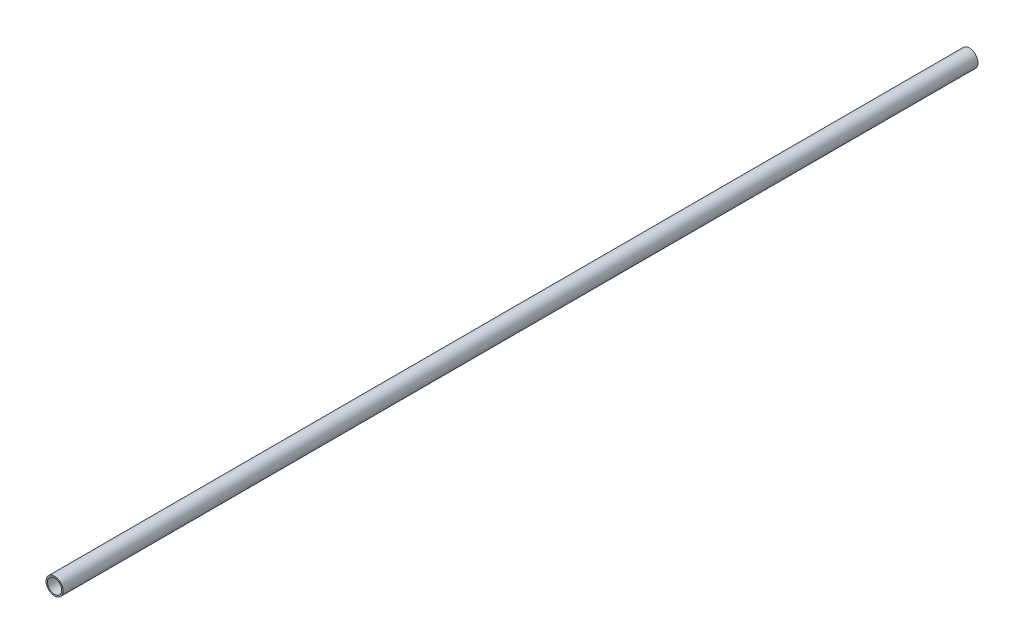
ISO-10303-21;
HEADER;
FILE_DESCRIPTION(('STEP AP214'),'2;1');
FILE_NAME('part.step','',(''),(''),'','','');
FILE_SCHEMA(('AUTOMOTIVE_DESIGN { 1 0 10303 214 1 1 1 1 }'));
ENDSEC;
DATA;
#1=APPLICATION_CONTEXT('core data for automotive mechanical design processes');
#2=APPLICATION_PROTOCOL_DEFINITION('international standard','automotive_design',2000,#1);
#3=PRODUCT_CONTEXT('',#1,'mechanical');
#4=PRODUCT('Part','Part','',(#3));
#5=PRODUCT_RELATED_PRODUCT_CATEGORY('part','',(#4));
#6=PRODUCT_DEFINITION_FORMATION('','',#4);
#7=PRODUCT_DEFINITION_CONTEXT('part definition',#1,'design');
#8=PRODUCT_DEFINITION('design','',#6,#7);
#9=PRODUCT_DEFINITION_SHAPE('','',#8);
#10=(LENGTH_UNIT() NAMED_UNIT(*) SI_UNIT(.MILLI.,.METRE.));
#11=(NAMED_UNIT(*) PLANE_ANGLE_UNIT() SI_UNIT($,.RADIAN.));
#12=(NAMED_UNIT(*) SI_UNIT($,.STERADIAN.) SOLID_ANGLE_UNIT());
#13=UNCERTAINTY_MEASURE_WITH_UNIT(LENGTH_MEASURE(1.E-05),#10,'distance_accuracy_value','');
#14=(GEOMETRIC_REPRESENTATION_CONTEXT(3) GLOBAL_UNCERTAINTY_ASSIGNED_CONTEXT((#13)) GLOBAL_UNIT_ASSIGNED_CONTEXT((#10,
#11,#12)) REPRESENTATION_CONTEXT('',''));
#15=CARTESIAN_POINT('',(0.,0.,0.));
#16=DIRECTION('',(0.,0.,1.));
#17=DIRECTION('',(1.,0.,0.));
#18=AXIS2_PLACEMENT_3D('',#15,#16,#17);
#19=CARTESIAN_POINT('',(0.,0.,0.25));
#20=DIRECTION('',(0.,0.,-1.));
#21=DIRECTION('',(-1.,0.,0.));
#22=AXIS2_PLACEMENT_3D('',#19,#20,#21);
#23=PLANE('',#22);
#24=CARTESIAN_POINT('',(0.,0.,0.25));
#25=DIRECTION('',(0.,0.,1.));
#26=DIRECTION('',(1.,0.,0.));
#27=AXIS2_PLACEMENT_3D('',#24,#25,#26);
#28=CIRCLE('',#27,1.25);
#29=CARTESIAN_POINT('',(1.25,0.,0.25));
#30=VERTEX_POINT('',#29);
#31=EDGE_CURVE('E18',#30,#30,#28,.T.);
#32=ORIENTED_EDGE('',*,*,#31,.T.);
#33=EDGE_LOOP('',(#32));
#34=FACE_BOUND('',#33,.T.);
#35=ADVANCED_FACE('F15',(#34),#23,.F.);
#36=CARTESIAN_POINT('',(0.,0.,0.));
#37=DIRECTION('',(0.,0.,1.));
#38=DIRECTION('',(1.,0.,0.));
#39=AXIS2_PLACEMENT_3D('',#36,#37,#38);
#40=CYLINDRICAL_SURFACE('',#39,1.25);
#41=ORIENTED_EDGE('',*,*,#31,.F.);
#42=EDGE_LOOP('',(#41));
#43=FACE_BOUND('',#42,.T.);
#44=CARTESIAN_POINT('',(0.,0.,160.));
#45=DIRECTION('',(0.,0.,1.));
#46=DIRECTION('',(1.,0.,0.));
#47=AXIS2_PLACEMENT_3D('',#44,#45,#46);
#48=CIRCLE('',#47,1.25);
#49=CARTESIAN_POINT('',(1.25,0.,160.));
#50=VERTEX_POINT('',#49);
#51=EDGE_CURVE('E27',#50,#50,#48,.T.);
#52=ORIENTED_EDGE('',*,*,#51,.T.);
#53=EDGE_LOOP('',(#52));
#54=FACE_BOUND('',#53,.T.);
#55=ADVANCED_FACE('F36',(#43,#54),#40,.F.);
#56=CARTESIAN_POINT('',(0.,0.,160.));
#57=DIRECTION('',(0.,0.,-1.));
#58=DIRECTION('',(-1.,0.,0.));
#59=AXIS2_PLACEMENT_3D('',#56,#57,#58);
#60=PLANE('',#59);
#61=CARTESIAN_POINT('',(0.,0.,160.));
#62=DIRECTION('',(0.,0.,1.));
#63=DIRECTION('',(1.,0.,0.));
#64=AXIS2_PLACEMENT_3D('',#61,#62,#63);
#65=CIRCLE('',#64,1.5);
#66=CARTESIAN_POINT('',(1.5,0.,160.));
#67=VERTEX_POINT('',#66);
#68=EDGE_CURVE('E22',#67,#67,#65,.F.);
#69=ORIENTED_EDGE('',*,*,#68,.F.);
#70=EDGE_LOOP('',(#69));
#71=FACE_BOUND('',#70,.T.);
#72=ORIENTED_EDGE('',*,*,#51,.F.);
#73=EDGE_LOOP('',(#72));
#74=FACE_BOUND('',#73,.T.);
#75=ADVANCED_FACE('F38',(#71,#74),#60,.F.);
#76=CARTESIAN_POINT('',(0.,0.,0.));
#77=DIRECTION('',(0.,0.,-1.));
#78=DIRECTION('',(-1.,0.,0.));
#79=AXIS2_PLACEMENT_3D('',#76,#77,#78);
#80=PLANE('',#79);
#81=CARTESIAN_POINT('',(0.,0.,0.));
#82=DIRECTION('',(0.,0.,1.));
#83=DIRECTION('',(1.,0.,0.));
#84=AXIS2_PLACEMENT_3D('',#81,#82,#83);
#85=CIRCLE('',#84,1.5);
#86=CARTESIAN_POINT('',(1.5,0.,0.));
#87=VERTEX_POINT('',#86);
#88=EDGE_CURVE('E10',#87,#87,#85,.T.);
#89=ORIENTED_EDGE('',*,*,#88,.F.);
#90=EDGE_LOOP('',(#89));
#91=FACE_BOUND('',#90,.T.);
#92=ADVANCED_FACE('F45',(#91),#80,.T.);
#93=CARTESIAN_POINT('',(0.,0.,0.));
#94=DIRECTION('',(0.,0.,1.));
#95=DIRECTION('',(1.,0.,0.));
#96=AXIS2_PLACEMENT_3D('',#93,#94,#95);
#97=CYLINDRICAL_SURFACE('',#96,1.5);
#98=ORIENTED_EDGE('',*,*,#88,.T.);
#99=EDGE_LOOP('',(#98));
#100=FACE_BOUND('',#99,.T.);
#101=ORIENTED_EDGE('',*,*,#68,.T.);
#102=EDGE_LOOP('',(#101));
#103=FACE_BOUND('',#102,.T.);
#104=ADVANCED_FACE('F48',(#100,#103),#97,.T.);
#105=CLOSED_SHELL('',(#35,#55,#75,#92,#104));
#106=MANIFOLD_SOLID_BREP('B1',#105);
#107=ADVANCED_BREP_SHAPE_REPRESENTATION('',(#18,#106),#14);
#108=SHAPE_DEFINITION_REPRESENTATION(#9,#107);
ENDSEC;
END-ISO-10303-21;
